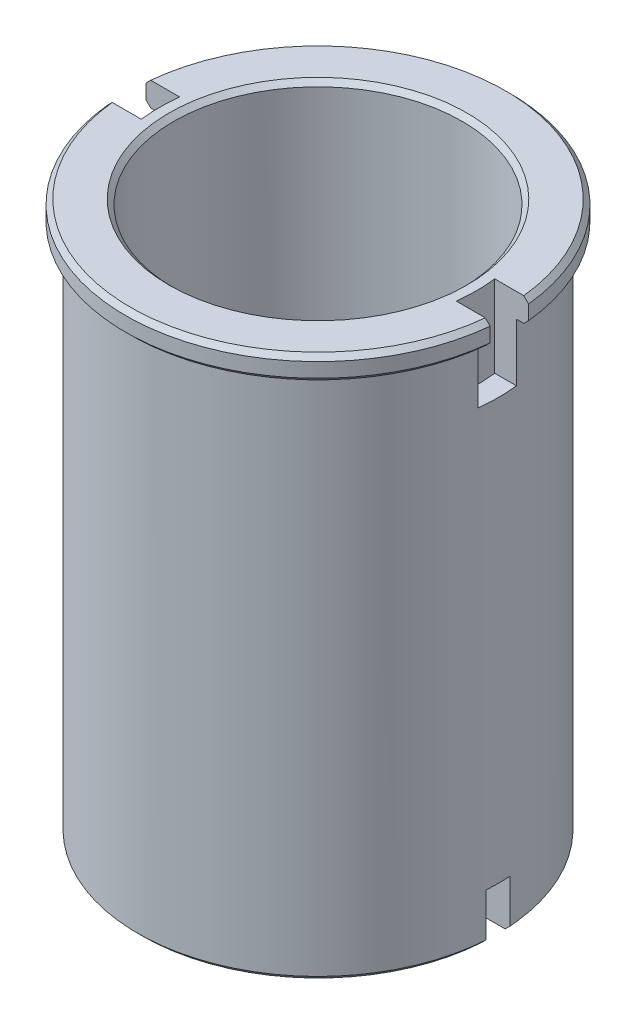
ISO-10303-21;
HEADER;
FILE_DESCRIPTION(('STEP AP214'),'2;1');
FILE_NAME('part.step','',(''),(''),'','','');
FILE_SCHEMA(('AUTOMOTIVE_DESIGN { 1 0 10303 214 1 1 1 1 }'));
ENDSEC;
DATA;
#1=APPLICATION_CONTEXT('core data for automotive mechanical design processes');
#2=APPLICATION_PROTOCOL_DEFINITION('international standard','automotive_design',2000,#1);
#3=PRODUCT_CONTEXT('',#1,'mechanical');
#4=PRODUCT('Part','Part','',(#3));
#5=PRODUCT_RELATED_PRODUCT_CATEGORY('part','',(#4));
#6=PRODUCT_DEFINITION_FORMATION('','',#4);
#7=PRODUCT_DEFINITION_CONTEXT('part definition',#1,'design');
#8=PRODUCT_DEFINITION('design','',#6,#7);
#9=PRODUCT_DEFINITION_SHAPE('','',#8);
#10=(LENGTH_UNIT() NAMED_UNIT(*) SI_UNIT(.MILLI.,.METRE.));
#11=(NAMED_UNIT(*) PLANE_ANGLE_UNIT() SI_UNIT($,.RADIAN.));
#12=(NAMED_UNIT(*) SI_UNIT($,.STERADIAN.) SOLID_ANGLE_UNIT());
#13=UNCERTAINTY_MEASURE_WITH_UNIT(LENGTH_MEASURE(1.E-05),#10,'distance_accuracy_value','');
#14=(GEOMETRIC_REPRESENTATION_CONTEXT(3) GLOBAL_UNCERTAINTY_ASSIGNED_CONTEXT((#13)) GLOBAL_UNIT_ASSIGNED_CONTEXT((#10,
#11,#12)) REPRESENTATION_CONTEXT('',''));
#15=CARTESIAN_POINT('',(0.,0.,0.));
#16=DIRECTION('',(0.,0.,1.));
#17=DIRECTION('',(1.,0.,0.));
#18=AXIS2_PLACEMENT_3D('',#15,#16,#17);
#19=CARTESIAN_POINT('',(0.,57.25,0.));
#20=DIRECTION('',(0.,-1.,0.));
#21=DIRECTION('',(0.,0.,-1.));
#22=AXIS2_PLACEMENT_3D('',#19,#20,#21);
#23=CYLINDRICAL_SURFACE('',#22,37.5);
#24=DIRECTION('',(0.,-1.,0.));
#25=VECTOR('',#24,1.);
#26=CARTESIAN_POINT('',(-37.4165738677394,57.25,2.5));
#27=LINE('',#26,#25);
#28=CARTESIAN_POINT('',(-37.4165738677394,-47.25,2.5));
#29=VERTEX_POINT('',#28);
#30=CARTESIAN_POINT('',(-37.4165738677394,-56.2499999999999,2.5));
#31=VERTEX_POINT('',#30);
#32=EDGE_CURVE('E323',#29,#31,#27,.T.);
#33=ORIENTED_EDGE('',*,*,#32,.T.);
#34=CARTESIAN_POINT('',(0.,-56.2499999999999,0.));
#35=DIRECTION('',(0.,1.,0.));
#36=DIRECTION('',(0.,0.,1.));
#37=AXIS2_PLACEMENT_3D('',#34,#35,#36);
#38=CIRCLE('',#37,37.5);
#39=CARTESIAN_POINT('',(37.4165738677394,-56.2499999999999,2.5));
#40=VERTEX_POINT('',#39);
#41=EDGE_CURVE('E528',#31,#40,#38,.T.);
#42=ORIENTED_EDGE('',*,*,#41,.T.);
#43=DIRECTION('',(0.,-1.,0.));
#44=VECTOR('',#43,1.);
#45=CARTESIAN_POINT('',(37.4165738677394,57.25,2.5));
#46=LINE('',#45,#44);
#47=CARTESIAN_POINT('',(37.4165738677394,-47.25,2.5));
#48=VERTEX_POINT('',#47);
#49=EDGE_CURVE('E321',#40,#48,#46,.F.);
#50=ORIENTED_EDGE('',*,*,#49,.T.);
#51=CARTESIAN_POINT('',(0.,-47.25,0.));
#52=DIRECTION('',(0.,-1.,0.));
#53=DIRECTION('',(0.,0.,-1.));
#54=AXIS2_PLACEMENT_3D('',#51,#52,#53);
#55=CIRCLE('',#54,37.5);
#56=CARTESIAN_POINT('',(37.4165738677394,-47.25,-2.5));
#57=VERTEX_POINT('',#56);
#58=EDGE_CURVE('E320',#57,#48,#55,.T.);
#59=ORIENTED_EDGE('',*,*,#58,.F.);
#60=DIRECTION('',(0.,-1.,0.));
#61=VECTOR('',#60,1.);
#62=CARTESIAN_POINT('',(37.4165738677394,57.25,-2.5));
#63=LINE('',#62,#61);
#64=CARTESIAN_POINT('',(37.4165738677394,-56.2499999999999,-2.5));
#65=VERTEX_POINT('',#64);
#66=EDGE_CURVE('E328',#57,#65,#63,.T.);
#67=ORIENTED_EDGE('',*,*,#66,.T.);
#68=CARTESIAN_POINT('',(0.,-56.2499999999999,0.));
#69=DIRECTION('',(0.,1.,0.));
#70=DIRECTION('',(0.,0.,1.));
#71=AXIS2_PLACEMENT_3D('',#68,#69,#70);
#72=CIRCLE('',#71,37.5);
#73=CARTESIAN_POINT('',(-37.4165738677394,-56.2499999999999,-2.5));
#74=VERTEX_POINT('',#73);
#75=EDGE_CURVE('E531',#65,#74,#72,.T.);
#76=ORIENTED_EDGE('',*,*,#75,.T.);
#77=DIRECTION('',(0.,-1.,0.));
#78=VECTOR('',#77,1.);
#79=CARTESIAN_POINT('',(-37.4165738677394,57.25,-2.5));
#80=LINE('',#79,#78);
#81=CARTESIAN_POINT('',(-37.4165738677394,-47.25,-2.5));
#82=VERTEX_POINT('',#81);
#83=EDGE_CURVE('E326',#74,#82,#80,.F.);
#84=ORIENTED_EDGE('',*,*,#83,.T.);
#85=EDGE_CURVE('E317',#29,#82,#55,.T.);
#86=ORIENTED_EDGE('',*,*,#85,.F.);
#87=EDGE_LOOP('',(#33,#42,#50,#59,#67,#76,#84,#86));
#88=FACE_BOUND('',#87,.T.);
#89=CARTESIAN_POINT('',(0.,52.25,0.));
#90=DIRECTION('',(0.,1.,0.));
#91=DIRECTION('',(0.,0.,1.));
#92=AXIS2_PLACEMENT_3D('',#89,#90,#91);
#93=CIRCLE('',#92,37.5);
#94=CARTESIAN_POINT('',(37.2860563750043,52.25,-4.00000000000001));
#95=VERTEX_POINT('',#94);
#96=CARTESIAN_POINT('',(-37.2860563750043,52.25,-4.));
#97=VERTEX_POINT('',#96);
#98=EDGE_CURVE('E334',#95,#97,#93,.T.);
#99=ORIENTED_EDGE('',*,*,#98,.F.);
#100=DIRECTION('',(0.,-1.,0.));
#101=VECTOR('',#100,1.);
#102=CARTESIAN_POINT('',(37.2860563750043,57.25,-4.00000000000001));
#103=LINE('',#102,#101);
#104=CARTESIAN_POINT('',(37.2860563750043,40.25,-4.00000000000001));
#105=VERTEX_POINT('',#104);
#106=EDGE_CURVE('E299',#95,#105,#103,.T.);
#107=ORIENTED_EDGE('',*,*,#106,.T.);
#108=CARTESIAN_POINT('',(0.,40.25,0.));
#109=DIRECTION('',(0.,1.,0.));
#110=DIRECTION('',(0.,0.,1.));
#111=AXIS2_PLACEMENT_3D('',#108,#109,#110);
#112=CIRCLE('',#111,37.5);
#113=CARTESIAN_POINT('',(37.2860563750043,40.25,3.99999999999999));
#114=VERTEX_POINT('',#113);
#115=EDGE_CURVE('E360',#114,#105,#112,.T.);
#116=ORIENTED_EDGE('',*,*,#115,.F.);
#117=DIRECTION('',(0.,-1.,0.));
#118=VECTOR('',#117,1.);
#119=CARTESIAN_POINT('',(37.2860563750043,57.25,3.99999999999999));
#120=LINE('',#119,#118);
#121=CARTESIAN_POINT('',(37.2860563750043,52.25,3.99999999999999));
#122=VERTEX_POINT('',#121);
#123=EDGE_CURVE('E231',#122,#114,#120,.T.);
#124=ORIENTED_EDGE('',*,*,#123,.F.);
#125=CARTESIAN_POINT('',(-37.2860563750043,52.25,4.));
#126=VERTEX_POINT('',#125);
#127=EDGE_CURVE('E331',#126,#122,#93,.T.);
#128=ORIENTED_EDGE('',*,*,#127,.F.);
#129=DIRECTION('',(0.,-1.,0.));
#130=VECTOR('',#129,1.);
#131=CARTESIAN_POINT('',(-37.2860563750043,57.25,4.));
#132=LINE('',#131,#130);
#133=CARTESIAN_POINT('',(-37.2860563750043,40.25,4.));
#134=VERTEX_POINT('',#133);
#135=EDGE_CURVE('E296',#134,#126,#132,.F.);
#136=ORIENTED_EDGE('',*,*,#135,.F.);
#137=CARTESIAN_POINT('',(0.,40.25,0.));
#138=DIRECTION('',(0.,1.,0.));
#139=DIRECTION('',(0.,0.,1.));
#140=AXIS2_PLACEMENT_3D('',#137,#138,#139);
#141=CIRCLE('',#140,37.5);
#142=CARTESIAN_POINT('',(-37.2860563750043,40.25,-4.));
#143=VERTEX_POINT('',#142);
#144=EDGE_CURVE('E358',#143,#134,#141,.T.);
#145=ORIENTED_EDGE('',*,*,#144,.F.);
#146=DIRECTION('',(0.,-1.,0.));
#147=VECTOR('',#146,1.);
#148=CARTESIAN_POINT('',(-37.2860563750043,57.25,-4.));
#149=LINE('',#148,#147);
#150=EDGE_CURVE('E260',#143,#97,#149,.F.);
#151=ORIENTED_EDGE('',*,*,#150,.T.);
#152=EDGE_LOOP('',(#99,#107,#116,#124,#128,#136,#145,#151));
#153=FACE_BOUND('',#152,.T.);
#154=ADVANCED_FACE('F34',(#88,#153),#23,.T.);
#155=CARTESIAN_POINT('',(0.,57.25,0.));
#156=DIRECTION('',(0.,1.,0.));
#157=DIRECTION('',(0.,0.,1.));
#158=AXIS2_PLACEMENT_3D('',#155,#156,#157);
#159=PLANE('',#158);
#160=CARTESIAN_POINT('',(0.,57.25,0.));
#161=DIRECTION('',(0.,1.,0.));
#162=DIRECTION('',(0.,0.,1.));
#163=AXIS2_PLACEMENT_3D('',#160,#161,#162);
#164=CIRCLE('',#163,31.0000000000001);
#165=CARTESIAN_POINT('',(0.,57.25,31.0000000000001));
#166=VERTEX_POINT('',#165);
#167=EDGE_CURVE('E362',#166,#166,#164,.F.);
#168=ORIENTED_EDGE('',*,*,#167,.T.);
#169=EDGE_LOOP('',(#168));
#170=FACE_BOUND('',#169,.T.);
#171=DIRECTION('',(-1.,0.,0.));
#172=VECTOR('',#171,1.);
#173=CARTESIAN_POINT('',(0.,57.25,-4.));
#174=LINE('',#173,#172);
#175=CARTESIAN_POINT('',(38.7943294825416,57.25,-4.00000000000001));
#176=VERTEX_POINT('',#175);
#177=CARTESIAN_POINT('',(32.7566787083184,57.25,-4.));
#178=VERTEX_POINT('',#177);
#179=EDGE_CURVE('E249',#176,#178,#174,.T.);
#180=ORIENTED_EDGE('',*,*,#179,.F.);
#181=CARTESIAN_POINT('',(0.,57.25,0.));
#182=DIRECTION('',(0.,1.,0.));
#183=DIRECTION('',(0.,0.,1.));
#184=AXIS2_PLACEMENT_3D('',#181,#182,#183);
#185=CIRCLE('',#184,39.);
#186=CARTESIAN_POINT('',(-38.7943294825416,57.25,-4.));
#187=VERTEX_POINT('',#186);
#188=EDGE_CURVE('E368',#176,#187,#185,.T.);
#189=ORIENTED_EDGE('',*,*,#188,.T.);
#190=DIRECTION('',(-1.,0.,0.));
#191=VECTOR('',#190,1.);
#192=CARTESIAN_POINT('',(0.,57.25,-4.));
#193=LINE('',#192,#191);
#194=CARTESIAN_POINT('',(-32.7566787083184,57.25,-4.));
#195=VERTEX_POINT('',#194);
#196=EDGE_CURVE('E280',#195,#187,#193,.T.);
#197=ORIENTED_EDGE('',*,*,#196,.F.);
#198=CARTESIAN_POINT('',(0.,57.25,0.));
#199=DIRECTION('',(0.,1.,0.));
#200=DIRECTION('',(0.,0.,1.));
#201=AXIS2_PLACEMENT_3D('',#198,#199,#200);
#202=CIRCLE('',#201,33.);
#203=CARTESIAN_POINT('',(-32.7566787083184,57.25,4.));
#204=VERTEX_POINT('',#203);
#205=EDGE_CURVE('E277',#195,#204,#202,.T.);
#206=ORIENTED_EDGE('',*,*,#205,.T.);
#207=DIRECTION('',(-1.,0.,0.));
#208=VECTOR('',#207,1.);
#209=CARTESIAN_POINT('',(0.,57.25,4.));
#210=LINE('',#209,#208);
#211=CARTESIAN_POINT('',(-38.7943294825416,57.25,4.));
#212=VERTEX_POINT('',#211);
#213=EDGE_CURVE('E270',#204,#212,#210,.T.);
#214=ORIENTED_EDGE('',*,*,#213,.T.);
#215=CARTESIAN_POINT('',(0.,57.25,0.));
#216=DIRECTION('',(0.,1.,0.));
#217=DIRECTION('',(0.,0.,1.));
#218=AXIS2_PLACEMENT_3D('',#215,#216,#217);
#219=CIRCLE('',#218,39.);
#220=CARTESIAN_POINT('',(38.7943294825416,57.25,3.99999999999999));
#221=VERTEX_POINT('',#220);
#222=EDGE_CURVE('E365',#212,#221,#219,.T.);
#223=ORIENTED_EDGE('',*,*,#222,.T.);
#224=DIRECTION('',(-1.,0.,0.));
#225=VECTOR('',#224,1.);
#226=CARTESIAN_POINT('',(0.,57.25,4.));
#227=LINE('',#226,#225);
#228=CARTESIAN_POINT('',(32.7566787083184,57.25,4.));
#229=VERTEX_POINT('',#228);
#230=EDGE_CURVE('E251',#221,#229,#227,.T.);
#231=ORIENTED_EDGE('',*,*,#230,.T.);
#232=CARTESIAN_POINT('',(0.,57.25,0.));
#233=DIRECTION('',(0.,1.,0.));
#234=DIRECTION('',(0.,0.,1.));
#235=AXIS2_PLACEMENT_3D('',#232,#233,#234);
#236=CIRCLE('',#235,33.);
#237=EDGE_CURVE('E244',#229,#178,#236,.T.);
#238=ORIENTED_EDGE('',*,*,#237,.T.);
#239=EDGE_LOOP('',(#180,#189,#197,#206,#214,#223,#231,#238));
#240=FACE_BOUND('',#239,.T.);
#241=ADVANCED_FACE('F582',(#170,#240),#159,.T.);
#242=CARTESIAN_POINT('',(0.,52.25,0.));
#243=DIRECTION('',(0.,1.,0.));
#244=DIRECTION('',(0.,0.,1.));
#245=AXIS2_PLACEMENT_3D('',#242,#243,#244);
#246=CYLINDRICAL_SURFACE('',#245,40.);
#247=DIRECTION('',(0.,1.,0.));
#248=VECTOR('',#247,1.);
#249=CARTESIAN_POINT('',(39.7994974842648,40.25,3.99999999999999));
#250=LINE('',#249,#248);
#251=CARTESIAN_POINT('',(39.7994974842648,53.25,3.99999999999999));
#252=VERTEX_POINT('',#251);
#253=CARTESIAN_POINT('',(39.7994974842648,56.25,3.99999999999999));
#254=VERTEX_POINT('',#253);
#255=EDGE_CURVE('E245',#252,#254,#250,.T.);
#256=ORIENTED_EDGE('',*,*,#255,.T.);
#257=CARTESIAN_POINT('',(0.,56.25,0.));
#258=DIRECTION('',(0.,1.,0.));
#259=DIRECTION('',(0.,0.,1.));
#260=AXIS2_PLACEMENT_3D('',#257,#258,#259);
#261=CIRCLE('',#260,40.);
#262=CARTESIAN_POINT('',(-39.7994974842648,56.25,4.));
#263=VERTEX_POINT('',#262);
#264=EDGE_CURVE('E547',#254,#263,#261,.F.);
#265=ORIENTED_EDGE('',*,*,#264,.T.);
#266=DIRECTION('',(0.,1.,0.));
#267=VECTOR('',#266,1.);
#268=CARTESIAN_POINT('',(-39.7994974842648,40.25,4.));
#269=LINE('',#268,#267);
#270=CARTESIAN_POINT('',(-39.7994974842648,53.25,4.));
#271=VERTEX_POINT('',#270);
#272=EDGE_CURVE('E287',#271,#263,#269,.T.);
#273=ORIENTED_EDGE('',*,*,#272,.F.);
#274=CARTESIAN_POINT('',(0.,53.25,0.));
#275=DIRECTION('',(0.,1.,0.));
#276=DIRECTION('',(0.,0.,1.));
#277=AXIS2_PLACEMENT_3D('',#274,#275,#276);
#278=CIRCLE('',#277,40.);
#279=EDGE_CURVE('E549',#271,#252,#278,.T.);
#280=ORIENTED_EDGE('',*,*,#279,.T.);
#281=EDGE_LOOP('',(#256,#265,#273,#280));
#282=FACE_BOUND('',#281,.T.);
#283=ADVANCED_FACE('F587',(#282),#246,.T.);
#284=DIRECTION('',(0.,1.,0.));
#285=VECTOR('',#284,1.);
#286=CARTESIAN_POINT('',(-39.7994974842648,40.25,-4.));
#287=LINE('',#286,#285);
#288=CARTESIAN_POINT('',(-39.7994974842648,53.25,-4.));
#289=VERTEX_POINT('',#288);
#290=CARTESIAN_POINT('',(-39.7994974842648,56.25,-4.));
#291=VERTEX_POINT('',#290);
#292=EDGE_CURVE('E290',#289,#291,#287,.T.);
#293=ORIENTED_EDGE('',*,*,#292,.T.);
#294=CARTESIAN_POINT('',(0.,56.25,0.));
#295=DIRECTION('',(0.,1.,0.));
#296=DIRECTION('',(0.,0.,1.));
#297=AXIS2_PLACEMENT_3D('',#294,#295,#296);
#298=CIRCLE('',#297,40.);
#299=CARTESIAN_POINT('',(39.7994974842648,56.25,-4.00000000000001));
#300=VERTEX_POINT('',#299);
#301=EDGE_CURVE('E611',#291,#300,#298,.F.);
#302=ORIENTED_EDGE('',*,*,#301,.T.);
#303=DIRECTION('',(0.,1.,0.));
#304=VECTOR('',#303,1.);
#305=CARTESIAN_POINT('',(39.7994974842648,40.25,-4.00000000000001));
#306=LINE('',#305,#304);
#307=CARTESIAN_POINT('',(39.7994974842648,53.25,-4.00000000000001));
#308=VERTEX_POINT('',#307);
#309=EDGE_CURVE('E261',#308,#300,#306,.T.);
#310=ORIENTED_EDGE('',*,*,#309,.F.);
#311=CARTESIAN_POINT('',(0.,53.25,0.));
#312=DIRECTION('',(0.,1.,0.));
#313=DIRECTION('',(0.,0.,1.));
#314=AXIS2_PLACEMENT_3D('',#311,#312,#313);
#315=CIRCLE('',#314,40.);
#316=EDGE_CURVE('E612',#308,#289,#315,.T.);
#317=ORIENTED_EDGE('',*,*,#316,.T.);
#318=EDGE_LOOP('',(#293,#302,#310,#317));
#319=FACE_BOUND('',#318,.T.);
#320=ADVANCED_FACE('F621',(#319),#246,.T.);
#321=CARTESIAN_POINT('',(0.,52.25,0.));
#322=DIRECTION('',(0.,1.,0.));
#323=DIRECTION('',(0.,0.,1.));
#324=AXIS2_PLACEMENT_3D('',#321,#322,#323);
#325=PLANE('',#324);
#326=DIRECTION('',(-1.,0.,0.));
#327=VECTOR('',#326,1.);
#328=CARTESIAN_POINT('',(0.,52.25,4.));
#329=LINE('',#328,#327);
#330=CARTESIAN_POINT('',(38.7943294825416,52.25,3.99999999999999));
#331=VERTEX_POINT('',#330);
#332=EDGE_CURVE('E354',#331,#122,#329,.T.);
#333=ORIENTED_EDGE('',*,*,#332,.F.);
#334=CARTESIAN_POINT('',(0.,52.25,0.));
#335=DIRECTION('',(0.,1.,0.));
#336=DIRECTION('',(0.,0.,1.));
#337=AXIS2_PLACEMENT_3D('',#334,#335,#336);
#338=CIRCLE('',#337,39.);
#339=CARTESIAN_POINT('',(-38.7943294825416,52.25,4.));
#340=VERTEX_POINT('',#339);
#341=EDGE_CURVE('E11',#331,#340,#338,.F.);
#342=ORIENTED_EDGE('',*,*,#341,.T.);
#343=DIRECTION('',(-1.,0.,0.));
#344=VECTOR('',#343,1.);
#345=CARTESIAN_POINT('',(0.,52.25,4.));
#346=LINE('',#345,#344);
#347=EDGE_CURVE('E351',#126,#340,#346,.T.);
#348=ORIENTED_EDGE('',*,*,#347,.F.);
#349=ORIENTED_EDGE('',*,*,#127,.T.);
#350=EDGE_LOOP('',(#333,#342,#348,#349));
#351=FACE_BOUND('',#350,.T.);
#352=ADVANCED_FACE('F644',(#351),#325,.F.);
#353=DIRECTION('',(-1.,0.,0.));
#354=VECTOR('',#353,1.);
#355=CARTESIAN_POINT('',(0.,52.25,-4.));
#356=LINE('',#355,#354);
#357=CARTESIAN_POINT('',(-38.7943294825416,52.25,-4.));
#358=VERTEX_POINT('',#357);
#359=EDGE_CURVE('E348',#97,#358,#356,.T.);
#360=ORIENTED_EDGE('',*,*,#359,.T.);
#361=CARTESIAN_POINT('',(0.,52.25,0.));
#362=DIRECTION('',(0.,1.,0.));
#363=DIRECTION('',(0.,0.,1.));
#364=AXIS2_PLACEMENT_3D('',#361,#362,#363);
#365=CIRCLE('',#364,39.);
#366=CARTESIAN_POINT('',(38.7943294825416,52.25,-4.00000000000001));
#367=VERTEX_POINT('',#366);
#368=EDGE_CURVE('E44',#358,#367,#365,.F.);
#369=ORIENTED_EDGE('',*,*,#368,.T.);
#370=DIRECTION('',(-1.,0.,0.));
#371=VECTOR('',#370,1.);
#372=CARTESIAN_POINT('',(0.,52.25,-4.));
#373=LINE('',#372,#371);
#374=EDGE_CURVE('E356',#367,#95,#373,.T.);
#375=ORIENTED_EDGE('',*,*,#374,.T.);
#376=ORIENTED_EDGE('',*,*,#98,.T.);
#377=EDGE_LOOP('',(#360,#369,#375,#376));
#378=FACE_BOUND('',#377,.T.);
#379=ADVANCED_FACE('F663',(#378),#325,.F.);
#380=CARTESIAN_POINT('',(0.,-57.25,0.));
#381=DIRECTION('',(0.,1.,0.));
#382=DIRECTION('',(0.,0.,1.));
#383=AXIS2_PLACEMENT_3D('',#380,#381,#382);
#384=PLANE('',#383);
#385=DIRECTION('',(1.,0.,0.));
#386=VECTOR('',#385,1.);
#387=CARTESIAN_POINT('',(-45.,-57.25,-2.5));
#388=LINE('',#387,#386);
#389=CARTESIAN_POINT('',(-36.4142829120661,-57.25,-2.5));
#390=VERTEX_POINT('',#389);
#391=CARTESIAN_POINT('',(-30.8990291109607,-57.25,-2.5));
#392=VERTEX_POINT('',#391);
#393=EDGE_CURVE('E307',#390,#392,#388,.T.);
#394=ORIENTED_EDGE('',*,*,#393,.F.);
#395=CARTESIAN_POINT('',(0.,-57.25,0.));
#396=DIRECTION('',(0.,1.,0.));
#397=DIRECTION('',(0.,0.,1.));
#398=AXIS2_PLACEMENT_3D('',#395,#396,#397);
#399=CIRCLE('',#398,36.4999999999999);
#400=CARTESIAN_POINT('',(36.4142829120661,-57.25,-2.5));
#401=VERTEX_POINT('',#400);
#402=EDGE_CURVE('E59',#390,#401,#399,.F.);
#403=ORIENTED_EDGE('',*,*,#402,.T.);
#404=CARTESIAN_POINT('',(30.8990291109607,-57.25,-2.5));
#405=VERTEX_POINT('',#404);
#406=EDGE_CURVE('E315',#405,#401,#388,.T.);
#407=ORIENTED_EDGE('',*,*,#406,.F.);
#408=CARTESIAN_POINT('',(0.,-57.25,0.));
#409=DIRECTION('',(0.,1.,0.));
#410=DIRECTION('',(0.,0.,1.));
#411=AXIS2_PLACEMENT_3D('',#408,#409,#410);
#412=CIRCLE('',#411,31.);
#413=EDGE_CURVE('E680',#405,#392,#412,.T.);
#414=ORIENTED_EDGE('',*,*,#413,.T.);
#415=EDGE_LOOP('',(#394,#403,#407,#414));
#416=FACE_BOUND('',#415,.T.);
#417=ADVANCED_FACE('F688',(#416),#384,.F.);
#418=DIRECTION('',(-1.,0.,0.));
#419=VECTOR('',#418,1.);
#420=CARTESIAN_POINT('',(-45.,-57.25,2.5));
#421=LINE('',#420,#419);
#422=CARTESIAN_POINT('',(36.4142829120661,-57.25,2.5));
#423=VERTEX_POINT('',#422);
#424=CARTESIAN_POINT('',(30.8990291109607,-57.25,2.5));
#425=VERTEX_POINT('',#424);
#426=EDGE_CURVE('E314',#423,#425,#421,.T.);
#427=ORIENTED_EDGE('',*,*,#426,.F.);
#428=CARTESIAN_POINT('',(0.,-57.25,0.));
#429=DIRECTION('',(0.,1.,0.));
#430=DIRECTION('',(0.,0.,1.));
#431=AXIS2_PLACEMENT_3D('',#428,#429,#430);
#432=CIRCLE('',#431,36.4999999999999);
#433=CARTESIAN_POINT('',(-36.4142829120661,-57.25,2.5));
#434=VERTEX_POINT('',#433);
#435=EDGE_CURVE('E491',#423,#434,#432,.F.);
#436=ORIENTED_EDGE('',*,*,#435,.T.);
#437=CARTESIAN_POINT('',(-30.8990291109607,-57.25,2.5));
#438=VERTEX_POINT('',#437);
#439=EDGE_CURVE('E302',#438,#434,#421,.T.);
#440=ORIENTED_EDGE('',*,*,#439,.F.);
#441=CARTESIAN_POINT('',(0.,-57.25,0.));
#442=DIRECTION('',(0.,1.,0.));
#443=DIRECTION('',(0.,0.,1.));
#444=AXIS2_PLACEMENT_3D('',#441,#442,#443);
#445=CIRCLE('',#444,31.);
#446=EDGE_CURVE('E514',#438,#425,#445,.T.);
#447=ORIENTED_EDGE('',*,*,#446,.T.);
#448=EDGE_LOOP('',(#427,#436,#440,#447));
#449=FACE_BOUND('',#448,.T.);
#450=ADVANCED_FACE('F522',(#449),#384,.F.);
#451=CARTESIAN_POINT('',(0.,57.25,0.));
#452=DIRECTION('',(0.,-1.,0.));
#453=DIRECTION('',(0.,0.,-1.));
#454=AXIS2_PLACEMENT_3D('',#451,#452,#453);
#455=CYLINDRICAL_SURFACE('',#454,30.);
#456=CARTESIAN_POINT('',(0.,56.2499999999999,0.));
#457=DIRECTION('',(0.,1.,0.));
#458=DIRECTION('',(0.,0.,1.));
#459=AXIS2_PLACEMENT_3D('',#456,#457,#458);
#460=CIRCLE('',#459,30.);
#461=CARTESIAN_POINT('',(0.,56.2499999999999,30.));
#462=VERTEX_POINT('',#461);
#463=EDGE_CURVE('E667',#462,#462,#460,.T.);
#464=ORIENTED_EDGE('',*,*,#463,.T.);
#465=EDGE_LOOP('',(#464));
#466=FACE_BOUND('',#465,.T.);
#467=DIRECTION('',(0.,-1.,0.));
#468=VECTOR('',#467,1.);
#469=CARTESIAN_POINT('',(-29.8956518577535,57.25,-2.5));
#470=LINE('',#469,#468);
#471=CARTESIAN_POINT('',(-29.8956518577535,-56.25,-2.5));
#472=VERTEX_POINT('',#471);
#473=CARTESIAN_POINT('',(-29.8956518577535,-47.25,-2.5));
#474=VERTEX_POINT('',#473);
#475=EDGE_CURVE('E342',#472,#474,#470,.F.);
#476=ORIENTED_EDGE('',*,*,#475,.F.);
#477=CARTESIAN_POINT('',(0.,-56.25,0.));
#478=DIRECTION('',(0.,1.,0.));
#479=DIRECTION('',(0.,0.,1.));
#480=AXIS2_PLACEMENT_3D('',#477,#478,#479);
#481=CIRCLE('',#480,30.);
#482=CARTESIAN_POINT('',(29.8956518577535,-56.25,-2.5));
#483=VERTEX_POINT('',#482);
#484=EDGE_CURVE('E51',#472,#483,#481,.F.);
#485=ORIENTED_EDGE('',*,*,#484,.T.);
#486=DIRECTION('',(0.,-1.,0.));
#487=VECTOR('',#486,1.);
#488=CARTESIAN_POINT('',(29.8956518577535,57.25,-2.5));
#489=LINE('',#488,#487);
#490=CARTESIAN_POINT('',(29.8956518577535,-47.25,-2.5));
#491=VERTEX_POINT('',#490);
#492=EDGE_CURVE('E346',#491,#483,#489,.T.);
#493=ORIENTED_EDGE('',*,*,#492,.F.);
#494=CARTESIAN_POINT('',(0.,-47.25,0.));
#495=DIRECTION('',(0.,-1.,0.));
#496=DIRECTION('',(0.,0.,-1.));
#497=AXIS2_PLACEMENT_3D('',#494,#495,#496);
#498=CIRCLE('',#497,30.);
#499=CARTESIAN_POINT('',(29.8956518577535,-47.25,2.5));
#500=VERTEX_POINT('',#499);
#501=EDGE_CURVE('E339',#491,#500,#498,.T.);
#502=ORIENTED_EDGE('',*,*,#501,.T.);
#503=DIRECTION('',(0.,-1.,0.));
#504=VECTOR('',#503,1.);
#505=CARTESIAN_POINT('',(29.8956518577535,57.25,2.5));
#506=LINE('',#505,#504);
#507=CARTESIAN_POINT('',(29.8956518577535,-56.25,2.5));
#508=VERTEX_POINT('',#507);
#509=EDGE_CURVE('E344',#508,#500,#506,.F.);
#510=ORIENTED_EDGE('',*,*,#509,.F.);
#511=CARTESIAN_POINT('',(0.,-56.25,0.));
#512=DIRECTION('',(0.,1.,0.));
#513=DIRECTION('',(0.,0.,1.));
#514=AXIS2_PLACEMENT_3D('',#511,#512,#513);
#515=CIRCLE('',#514,30.);
#516=CARTESIAN_POINT('',(-29.8956518577535,-56.25,2.5));
#517=VERTEX_POINT('',#516);
#518=EDGE_CURVE('E664',#508,#517,#515,.F.);
#519=ORIENTED_EDGE('',*,*,#518,.T.);
#520=DIRECTION('',(0.,-1.,0.));
#521=VECTOR('',#520,1.);
#522=CARTESIAN_POINT('',(-29.8956518577535,57.25,2.5));
#523=LINE('',#522,#521);
#524=CARTESIAN_POINT('',(-29.8956518577535,-47.25,2.5));
#525=VERTEX_POINT('',#524);
#526=EDGE_CURVE('E338',#525,#517,#523,.T.);
#527=ORIENTED_EDGE('',*,*,#526,.F.);
#528=EDGE_CURVE('E335',#525,#474,#498,.T.);
#529=ORIENTED_EDGE('',*,*,#528,.T.);
#530=EDGE_LOOP('',(#476,#485,#493,#502,#510,#519,#527,#529));
#531=FACE_BOUND('',#530,.T.);
#532=ADVANCED_FACE('F685',(#466,#531),#455,.F.);
#533=CARTESIAN_POINT('',(0.,-47.25,0.));
#534=DIRECTION('',(0.,-1.,0.));
#535=DIRECTION('',(0.,0.,-1.));
#536=AXIS2_PLACEMENT_3D('',#533,#534,#535);
#537=PLANE('',#536);
#538=ORIENTED_EDGE('',*,*,#85,.T.);
#539=DIRECTION('',(1.,0.,0.));
#540=VECTOR('',#539,1.);
#541=CARTESIAN_POINT('',(-45.,-47.25,-2.5));
#542=LINE('',#541,#540);
#543=EDGE_CURVE('E311',#82,#474,#542,.T.);
#544=ORIENTED_EDGE('',*,*,#543,.T.);
#545=ORIENTED_EDGE('',*,*,#528,.F.);
#546=DIRECTION('',(-1.,0.,0.));
#547=VECTOR('',#546,1.);
#548=CARTESIAN_POINT('',(-45.,-47.25,2.5));
#549=LINE('',#548,#547);
#550=EDGE_CURVE('E303',#525,#29,#549,.T.);
#551=ORIENTED_EDGE('',*,*,#550,.T.);
#552=EDGE_LOOP('',(#538,#544,#545,#551));
#553=FACE_BOUND('',#552,.T.);
#554=ADVANCED_FACE('F409',(#553),#537,.T.);
#555=CARTESIAN_POINT('',(-45.,-47.25,2.5));
#556=DIRECTION('',(0.,0.,1.));
#557=DIRECTION('',(1.,0.,0.));
#558=AXIS2_PLACEMENT_3D('',#555,#556,#557);
#559=PLANE('',#558);
#560=ORIENTED_EDGE('',*,*,#439,.T.);
#561=CARTESIAN_POINT('',(-36.4142829120661,-57.25,2.5));
#562=CARTESIAN_POINT('',(-36.5813365703859,-57.0833385108742,2.5));
#563=CARTESIAN_POINT('',(-36.7483876458521,-56.9166744329777,2.5));
#564=CARTESIAN_POINT('',(-37.0824846310766,-56.5833410996443,2.5));
#565=CARTESIAN_POINT('',(-37.2495305408347,-56.4166718442074,2.5));
#566=CARTESIAN_POINT('',(-37.4165738677394,-56.2499999999999,2.5));
#567=B_SPLINE_CURVE_WITH_KNOTS('',3,(#561,#562,#563,#564,#565,#566),.UNSPECIFIED.,.F.,.F.,(4,2,
4),(0.,0.707917219793237,1.41583443958188),.UNSPECIFIED.);
#568=EDGE_CURVE('E490',#434,#31,#567,.T.);
#569=ORIENTED_EDGE('',*,*,#568,.T.);
#570=ORIENTED_EDGE('',*,*,#32,.F.);
#571=ORIENTED_EDGE('',*,*,#550,.F.);
#572=ORIENTED_EDGE('',*,*,#526,.T.);
#573=CARTESIAN_POINT('',(-29.8956518577535,-56.25,2.5));
#574=CARTESIAN_POINT('',(-30.0628906429538,-56.4166573924558,2.5));
#575=CARTESIAN_POINT('',(-30.2301248066556,-56.5833194220181,2.5));
#576=CARTESIAN_POINT('',(-30.564583891058,-56.9166527553514,2.5));
#577=CARTESIAN_POINT('',(-30.7318088117586,-57.0833240591225,2.5));
#578=CARTESIAN_POINT('',(-30.8990291109607,-57.25,2.5));
#579=B_SPLINE_CURVE_WITH_KNOTS('',3,(#573,#574,#575,#576,#577,#578),.UNSPECIFIED.,.F.,.F.,(4,2,
4),(0.,0.708301827233135,1.41660365444842),.UNSPECIFIED.);
#580=EDGE_CURVE('E484',#517,#438,#579,.T.);
#581=ORIENTED_EDGE('',*,*,#580,.T.);
#582=EDGE_LOOP('',(#560,#569,#570,#571,#572,#581));
#583=FACE_BOUND('',#582,.T.);
#584=ADVANCED_FACE('F416',(#583),#559,.F.);
#585=CARTESIAN_POINT('',(-45.,-47.25,-2.5));
#586=DIRECTION('',(0.,0.,-1.));
#587=DIRECTION('',(-1.,0.,0.));
#588=AXIS2_PLACEMENT_3D('',#585,#586,#587);
#589=PLANE('',#588);
#590=ORIENTED_EDGE('',*,*,#83,.F.);
#591=CARTESIAN_POINT('',(-37.4165738677394,-56.2499999999999,-2.5));
#592=CARTESIAN_POINT('',(-37.2495305408347,-56.4166718442074,-2.5));
#593=CARTESIAN_POINT('',(-37.0824846310766,-56.5833410996443,-2.5));
#594=CARTESIAN_POINT('',(-36.7483876458521,-56.9166744329777,-2.5));
#595=CARTESIAN_POINT('',(-36.5813365703859,-57.0833385108742,-2.5));
#596=CARTESIAN_POINT('',(-36.4142829120661,-57.25,-2.5));
#597=B_SPLINE_CURVE_WITH_KNOTS('',3,(#591,#592,#593,#594,#595,#596),.UNSPECIFIED.,.F.,.F.,(4,2,
4),(0.,0.707917219788641,1.41583443958188),.UNSPECIFIED.);
#598=EDGE_CURVE('E432',#74,#390,#597,.T.);
#599=ORIENTED_EDGE('',*,*,#598,.T.);
#600=ORIENTED_EDGE('',*,*,#393,.T.);
#601=CARTESIAN_POINT('',(-30.8990291109607,-57.25,-2.5));
#602=CARTESIAN_POINT('',(-30.7318088117586,-57.0833240591225,-2.5));
#603=CARTESIAN_POINT('',(-30.564583891058,-56.9166527553514,-2.5));
#604=CARTESIAN_POINT('',(-30.2301248066556,-56.5833194220181,-2.5));
#605=CARTESIAN_POINT('',(-30.0628906429538,-56.4166573924558,-2.5));
#606=CARTESIAN_POINT('',(-29.8956518577535,-56.25,-2.5));
#607=B_SPLINE_CURVE_WITH_KNOTS('',3,(#601,#602,#603,#604,#605,#606),.UNSPECIFIED.,.F.,.F.,(4,2,
4),(0.,0.708301827215283,1.41660365444842),.UNSPECIFIED.);
#608=EDGE_CURVE('E422',#392,#472,#607,.T.);
#609=ORIENTED_EDGE('',*,*,#608,.T.);
#610=ORIENTED_EDGE('',*,*,#475,.T.);
#611=ORIENTED_EDGE('',*,*,#543,.F.);
#612=EDGE_LOOP('',(#590,#599,#600,#609,#610,#611));
#613=FACE_BOUND('',#612,.T.);
#614=ADVANCED_FACE('F414',(#613),#589,.F.);
#615=ORIENTED_EDGE('',*,*,#406,.T.);
#616=CARTESIAN_POINT('',(36.4142829120661,-57.25,-2.5));
#617=CARTESIAN_POINT('',(36.5813365703859,-57.0833385108742,-2.5));
#618=CARTESIAN_POINT('',(36.7483876458521,-56.9166744329777,-2.5));
#619=CARTESIAN_POINT('',(37.0824846310766,-56.5833410996443,-2.5));
#620=CARTESIAN_POINT('',(37.2495305408347,-56.4166718442074,-2.5));
#621=CARTESIAN_POINT('',(37.4165738677394,-56.2499999999999,-2.5));
#622=B_SPLINE_CURVE_WITH_KNOTS('',3,(#616,#617,#618,#619,#620,#621),.UNSPECIFIED.,.F.,.F.,(4,2,
4),(0.,0.707917219793237,1.41583443958188),.UNSPECIFIED.);
#623=EDGE_CURVE('E446',#401,#65,#622,.T.);
#624=ORIENTED_EDGE('',*,*,#623,.T.);
#625=ORIENTED_EDGE('',*,*,#66,.F.);
#626=EDGE_CURVE('E308',#491,#57,#542,.T.);
#627=ORIENTED_EDGE('',*,*,#626,.F.);
#628=ORIENTED_EDGE('',*,*,#492,.T.);
#629=CARTESIAN_POINT('',(29.8956518577535,-56.25,-2.5));
#630=CARTESIAN_POINT('',(30.0628906429538,-56.4166573924558,-2.5));
#631=CARTESIAN_POINT('',(30.2301248066556,-56.5833194220181,-2.5));
#632=CARTESIAN_POINT('',(30.564583891058,-56.9166527553514,-2.5));
#633=CARTESIAN_POINT('',(30.7318088117586,-57.0833240591225,-2.5));
#634=CARTESIAN_POINT('',(30.8990291109607,-57.25,-2.5));
#635=B_SPLINE_CURVE_WITH_KNOTS('',3,(#629,#630,#631,#632,#633,#634),.UNSPECIFIED.,.F.,.F.,(4,2,
4),(0.,0.708301827233135,1.41660365444842),.UNSPECIFIED.);
#636=EDGE_CURVE('E440',#483,#405,#635,.T.);
#637=ORIENTED_EDGE('',*,*,#636,.T.);
#638=EDGE_LOOP('',(#615,#624,#625,#627,#628,#637));
#639=FACE_BOUND('',#638,.T.);
#640=ADVANCED_FACE('F410',(#639),#589,.F.);
#641=ORIENTED_EDGE('',*,*,#49,.F.);
#642=CARTESIAN_POINT('',(37.4165738677394,-56.2499999999999,2.5));
#643=CARTESIAN_POINT('',(37.2495305408347,-56.4166718442074,2.5));
#644=CARTESIAN_POINT('',(37.0824846310766,-56.5833410996443,2.5));
#645=CARTESIAN_POINT('',(36.7483876458521,-56.9166744329777,2.5));
#646=CARTESIAN_POINT('',(36.5813365703859,-57.0833385108742,2.5));
#647=CARTESIAN_POINT('',(36.4142829120661,-57.25,2.5));
#648=B_SPLINE_CURVE_WITH_KNOTS('',3,(#642,#643,#644,#645,#646,#647),.UNSPECIFIED.,.F.,.F.,(4,2,
4),(0.,0.707917219788641,1.41583443958188),.UNSPECIFIED.);
#649=EDGE_CURVE('E509',#40,#423,#648,.T.);
#650=ORIENTED_EDGE('',*,*,#649,.T.);
#651=ORIENTED_EDGE('',*,*,#426,.T.);
#652=CARTESIAN_POINT('',(30.8990291109607,-57.25,2.5));
#653=CARTESIAN_POINT('',(30.7318088117586,-57.0833240591225,2.5));
#654=CARTESIAN_POINT('',(30.564583891058,-56.9166527553514,2.5));
#655=CARTESIAN_POINT('',(30.2301248066556,-56.5833194220181,2.5));
#656=CARTESIAN_POINT('',(30.0628906429538,-56.4166573924558,2.5));
#657=CARTESIAN_POINT('',(29.8956518577535,-56.25,2.5));
#658=B_SPLINE_CURVE_WITH_KNOTS('',3,(#652,#653,#654,#655,#656,#657),.UNSPECIFIED.,.F.,.F.,(4,2,
4),(0.,0.708301827215283,1.41660365444842),.UNSPECIFIED.);
#659=EDGE_CURVE('E476',#425,#508,#658,.T.);
#660=ORIENTED_EDGE('',*,*,#659,.T.);
#661=ORIENTED_EDGE('',*,*,#509,.T.);
#662=EDGE_CURVE('E306',#48,#500,#549,.T.);
#663=ORIENTED_EDGE('',*,*,#662,.F.);
#664=EDGE_LOOP('',(#641,#650,#651,#660,#661,#663));
#665=FACE_BOUND('',#664,.T.);
#666=ADVANCED_FACE('F407',(#665),#559,.F.);
#667=ORIENTED_EDGE('',*,*,#58,.T.);
#668=ORIENTED_EDGE('',*,*,#662,.T.);
#669=ORIENTED_EDGE('',*,*,#501,.F.);
#670=ORIENTED_EDGE('',*,*,#626,.T.);
#671=EDGE_LOOP('',(#667,#668,#669,#670));
#672=FACE_BOUND('',#671,.T.);
#673=ADVANCED_FACE('F403',(#672),#537,.T.);
#674=CARTESIAN_POINT('',(0.,40.25,0.));
#675=DIRECTION('',(0.,1.,0.));
#676=DIRECTION('',(0.,0.,1.));
#677=AXIS2_PLACEMENT_3D('',#674,#675,#676);
#678=PLANE('',#677);
#679=ORIENTED_EDGE('',*,*,#144,.T.);
#680=DIRECTION('',(-1.,0.,0.));
#681=VECTOR('',#680,1.);
#682=CARTESIAN_POINT('',(0.,40.25,4.));
#683=LINE('',#682,#681);
#684=CARTESIAN_POINT('',(-32.7566787083184,40.25,4.));
#685=VERTEX_POINT('',#684);
#686=EDGE_CURVE('E273',#685,#134,#683,.T.);
#687=ORIENTED_EDGE('',*,*,#686,.F.);
#688=CARTESIAN_POINT('',(0.,40.25,0.));
#689=DIRECTION('',(0.,1.,0.));
#690=DIRECTION('',(0.,0.,1.));
#691=AXIS2_PLACEMENT_3D('',#688,#689,#690);
#692=CIRCLE('',#691,33.);
#693=CARTESIAN_POINT('',(-32.7566787083184,40.25,-4.));
#694=VERTEX_POINT('',#693);
#695=EDGE_CURVE('E266',#694,#685,#692,.T.);
#696=ORIENTED_EDGE('',*,*,#695,.F.);
#697=DIRECTION('',(-1.,0.,0.));
#698=VECTOR('',#697,1.);
#699=CARTESIAN_POINT('',(0.,40.25,-4.));
#700=LINE('',#699,#698);
#701=EDGE_CURVE('E269',#694,#143,#700,.T.);
#702=ORIENTED_EDGE('',*,*,#701,.T.);
#703=EDGE_LOOP('',(#679,#687,#696,#702));
#704=FACE_BOUND('',#703,.T.);
#705=ADVANCED_FACE('F406',(#704),#678,.T.);
#706=CARTESIAN_POINT('',(0.,40.25,4.));
#707=DIRECTION('',(0.,0.,-1.));
#708=DIRECTION('',(-1.,0.,0.));
#709=AXIS2_PLACEMENT_3D('',#706,#707,#708);
#710=PLANE('',#709);
#711=ORIENTED_EDGE('',*,*,#272,.T.);
#712=CARTESIAN_POINT('',(-39.7994974842648,56.25,4.));
#713=CARTESIAN_POINT('',(-39.6319804149652,56.416677654141,4.));
#714=CARTESIAN_POINT('',(-39.4644578801729,56.5833498145437,4.));
#715=CARTESIAN_POINT('',(-39.1294018795985,56.9166831478771,4.));
#716=CARTESIAN_POINT('',(-38.9618684138164,57.0833443208077,4.));
#717=CARTESIAN_POINT('',(-38.7943294825416,57.25,4.));
#718=B_SPLINE_CURVE_WITH_KNOTS('',3,(#712,#713,#714,#715,#716,#717),.UNSPECIFIED.,.F.,.F.,(4,2,
4),(0.,0.708936300699033,1.41787260141738),.UNSPECIFIED.);
#719=EDGE_CURVE('E533',#263,#212,#718,.T.);
#720=ORIENTED_EDGE('',*,*,#719,.T.);
#721=ORIENTED_EDGE('',*,*,#213,.F.);
#722=DIRECTION('',(0.,1.,0.));
#723=VECTOR('',#722,1.);
#724=CARTESIAN_POINT('',(-32.7566787083184,40.25,4.));
#725=LINE('',#724,#723);
#726=EDGE_CURVE('E256',#685,#204,#725,.T.);
#727=ORIENTED_EDGE('',*,*,#726,.F.);
#728=ORIENTED_EDGE('',*,*,#686,.T.);
#729=ORIENTED_EDGE('',*,*,#135,.T.);
#730=ORIENTED_EDGE('',*,*,#347,.T.);
#731=CARTESIAN_POINT('',(-38.7943294825416,52.25,4.));
#732=CARTESIAN_POINT('',(-38.9618684138164,52.4166556791923,4.));
#733=CARTESIAN_POINT('',(-39.1294018795985,52.583316852123,4.));
#734=CARTESIAN_POINT('',(-39.4644578801729,52.9166501854563,4.));
#735=CARTESIAN_POINT('',(-39.6319804149652,53.083322345859,4.));
#736=CARTESIAN_POINT('',(-39.7994974842648,53.25,4.));
#737=B_SPLINE_CURVE_WITH_KNOTS('',3,(#731,#732,#733,#734,#735,#736),.UNSPECIFIED.,.F.,.F.,(4,2,
4),(0.,0.708936300718355,1.41787260141741),.UNSPECIFIED.);
#738=EDGE_CURVE('E541',#340,#271,#737,.T.);
#739=ORIENTED_EDGE('',*,*,#738,.T.);
#740=EDGE_LOOP('',(#711,#720,#721,#727,#728,#729,#730,#739));
#741=FACE_BOUND('',#740,.T.);
#742=ADVANCED_FACE('F395',(#741),#710,.T.);
#743=CARTESIAN_POINT('',(0.,40.25,-4.));
#744=DIRECTION('',(0.,0.,-1.));
#745=DIRECTION('',(-1.,0.,0.));
#746=AXIS2_PLACEMENT_3D('',#743,#744,#745);
#747=PLANE('',#746);
#748=ORIENTED_EDGE('',*,*,#196,.T.);
#749=CARTESIAN_POINT('',(-38.7943294825416,57.25,-4.));
#750=CARTESIAN_POINT('',(-38.9618684138164,57.0833443208077,-4.));
#751=CARTESIAN_POINT('',(-39.1294018795985,56.9166831478771,-4.));
#752=CARTESIAN_POINT('',(-39.4644578801729,56.5833498145437,-4.));
#753=CARTESIAN_POINT('',(-39.6319804149652,56.416677654141,-4.));
#754=CARTESIAN_POINT('',(-39.7994974842648,56.25,-4.));
#755=B_SPLINE_CURVE_WITH_KNOTS('',3,(#749,#750,#751,#752,#753,#754),.UNSPECIFIED.,.F.,.F.,(4,2,
4),(0.,0.708936300718345,1.41787260141738),.UNSPECIFIED.);
#756=EDGE_CURVE('E378',#187,#291,#755,.T.);
#757=ORIENTED_EDGE('',*,*,#756,.T.);
#758=ORIENTED_EDGE('',*,*,#292,.F.);
#759=CARTESIAN_POINT('',(-39.7994974842648,53.25,-4.));
#760=CARTESIAN_POINT('',(-39.6319804149652,53.083322345859,-4.));
#761=CARTESIAN_POINT('',(-39.4644578801729,52.9166501854563,-4.));
#762=CARTESIAN_POINT('',(-39.1294018795985,52.583316852123,-4.));
#763=CARTESIAN_POINT('',(-38.9618684138164,52.4166556791923,-4.));
#764=CARTESIAN_POINT('',(-38.7943294825416,52.25,-4.));
#765=B_SPLINE_CURVE_WITH_KNOTS('',3,(#759,#760,#761,#762,#763,#764),.UNSPECIFIED.,.F.,.F.,(4,2,
4),(0.,0.708936300699053,1.4178726014174),.UNSPECIFIED.);
#766=EDGE_CURVE('E371',#289,#358,#765,.T.);
#767=ORIENTED_EDGE('',*,*,#766,.T.);
#768=ORIENTED_EDGE('',*,*,#359,.F.);
#769=ORIENTED_EDGE('',*,*,#150,.F.);
#770=ORIENTED_EDGE('',*,*,#701,.F.);
#771=DIRECTION('',(0.,1.,0.));
#772=VECTOR('',#771,1.);
#773=CARTESIAN_POINT('',(-32.7566787083184,40.25,-4.));
#774=LINE('',#773,#772);
#775=EDGE_CURVE('E276',#694,#195,#774,.T.);
#776=ORIENTED_EDGE('',*,*,#775,.T.);
#777=EDGE_LOOP('',(#748,#757,#758,#767,#768,#769,#770,#776));
#778=FACE_BOUND('',#777,.T.);
#779=ADVANCED_FACE('F389',(#778),#747,.F.);
#780=CARTESIAN_POINT('',(0.,40.25,0.));
#781=DIRECTION('',(0.,1.,0.));
#782=DIRECTION('',(0.,0.,1.));
#783=AXIS2_PLACEMENT_3D('',#780,#781,#782);
#784=CYLINDRICAL_SURFACE('',#783,33.);
#785=ORIENTED_EDGE('',*,*,#205,.F.);
#786=ORIENTED_EDGE('',*,*,#775,.F.);
#787=ORIENTED_EDGE('',*,*,#695,.T.);
#788=ORIENTED_EDGE('',*,*,#726,.T.);
#789=EDGE_LOOP('',(#785,#786,#787,#788));
#790=FACE_BOUND('',#789,.T.);
#791=ADVANCED_FACE('F394',(#790),#784,.T.);
#792=CARTESIAN_POINT('',(0.,40.25,0.));
#793=DIRECTION('',(0.,1.,0.));
#794=DIRECTION('',(0.,0.,1.));
#795=AXIS2_PLACEMENT_3D('',#792,#793,#794);
#796=PLANE('',#795);
#797=ORIENTED_EDGE('',*,*,#115,.T.);
#798=DIRECTION('',(-1.,0.,0.));
#799=VECTOR('',#798,1.);
#800=CARTESIAN_POINT('',(0.,40.25,-4.));
#801=LINE('',#800,#799);
#802=CARTESIAN_POINT('',(32.7566787083184,40.25,-4.));
#803=VERTEX_POINT('',#802);
#804=EDGE_CURVE('E235',#105,#803,#801,.T.);
#805=ORIENTED_EDGE('',*,*,#804,.T.);
#806=CARTESIAN_POINT('',(0.,40.25,0.));
#807=DIRECTION('',(0.,1.,0.));
#808=DIRECTION('',(0.,0.,1.));
#809=AXIS2_PLACEMENT_3D('',#806,#807,#808);
#810=CIRCLE('',#809,33.);
#811=CARTESIAN_POINT('',(32.7566787083184,40.25,4.));
#812=VERTEX_POINT('',#811);
#813=EDGE_CURVE('E236',#812,#803,#810,.T.);
#814=ORIENTED_EDGE('',*,*,#813,.F.);
#815=DIRECTION('',(-1.,0.,0.));
#816=VECTOR('',#815,1.);
#817=CARTESIAN_POINT('',(0.,40.25,4.));
#818=LINE('',#817,#816);
#819=EDGE_CURVE('E224',#114,#812,#818,.T.);
#820=ORIENTED_EDGE('',*,*,#819,.F.);
#821=EDGE_LOOP('',(#797,#805,#814,#820));
#822=FACE_BOUND('',#821,.T.);
#823=ADVANCED_FACE('F247',(#822),#796,.T.);
#824=CARTESIAN_POINT('',(0.,40.25,-4.));
#825=DIRECTION('',(0.,0.,-1.));
#826=DIRECTION('',(-1.,0.,0.));
#827=AXIS2_PLACEMENT_3D('',#824,#825,#826);
#828=PLANE('',#827);
#829=ORIENTED_EDGE('',*,*,#309,.T.);
#830=CARTESIAN_POINT('',(39.7994974842648,56.25,-4.00000000000001));
#831=CARTESIAN_POINT('',(39.6319804149652,56.416677654141,-4.00000000000001));
#832=CARTESIAN_POINT('',(39.4644578801729,56.5833498145437,-4.00000000000001));
#833=CARTESIAN_POINT('',(39.1294018795985,56.9166831478771,-4.00000000000001));
#834=CARTESIAN_POINT('',(38.9618684138164,57.0833443208077,-4.00000000000001));
#835=CARTESIAN_POINT('',(38.7943294825416,57.25,-4.00000000000001));
#836=B_SPLINE_CURVE_WITH_KNOTS('',3,(#830,#831,#832,#833,#834,#835),.UNSPECIFIED.,.F.,.F.,(4,2,
4),(0.,0.708936300699033,1.41787260141738),.UNSPECIFIED.);
#837=EDGE_CURVE('E599',#300,#176,#836,.T.);
#838=ORIENTED_EDGE('',*,*,#837,.T.);
#839=ORIENTED_EDGE('',*,*,#179,.T.);
#840=DIRECTION('',(0.,1.,0.));
#841=VECTOR('',#840,1.);
#842=CARTESIAN_POINT('',(32.7566787083184,40.25,-4.));
#843=LINE('',#842,#841);
#844=EDGE_CURVE('E258',#803,#178,#843,.T.);
#845=ORIENTED_EDGE('',*,*,#844,.F.);
#846=ORIENTED_EDGE('',*,*,#804,.F.);
#847=ORIENTED_EDGE('',*,*,#106,.F.);
#848=ORIENTED_EDGE('',*,*,#374,.F.);
#849=CARTESIAN_POINT('',(38.7943294825416,52.25,-4.00000000000001));
#850=CARTESIAN_POINT('',(38.9618684138164,52.4166556791923,-4.00000000000001));
#851=CARTESIAN_POINT('',(39.1294018795985,52.583316852123,-4.00000000000001));
#852=CARTESIAN_POINT('',(39.4644578801729,52.9166501854563,-4.00000000000001));
#853=CARTESIAN_POINT('',(39.6319804149652,53.083322345859,-4.00000000000001));
#854=CARTESIAN_POINT('',(39.7994974842648,53.25,-4.00000000000001));
#855=B_SPLINE_CURVE_WITH_KNOTS('',3,(#849,#850,#851,#852,#853,#854),.UNSPECIFIED.,.F.,.F.,(4,2,
4),(0.,0.708936300718355,1.41787260141741),.UNSPECIFIED.);
#856=EDGE_CURVE('E605',#367,#308,#855,.T.);
#857=ORIENTED_EDGE('',*,*,#856,.T.);
#858=EDGE_LOOP('',(#829,#838,#839,#845,#846,#847,#848,#857));
#859=FACE_BOUND('',#858,.T.);
#860=ADVANCED_FACE('F569',(#859),#828,.F.);
#861=CARTESIAN_POINT('',(0.,40.25,4.));
#862=DIRECTION('',(0.,0.,-1.));
#863=DIRECTION('',(-1.,0.,0.));
#864=AXIS2_PLACEMENT_3D('',#861,#862,#863);
#865=PLANE('',#864);
#866=ORIENTED_EDGE('',*,*,#230,.F.);
#867=CARTESIAN_POINT('',(38.7943294825416,57.25,3.99999999999999));
#868=CARTESIAN_POINT('',(38.9618684138164,57.0833443208077,3.99999999999999));
#869=CARTESIAN_POINT('',(39.1294018795985,56.9166831478771,3.99999999999999));
#870=CARTESIAN_POINT('',(39.4644578801729,56.5833498145437,3.99999999999999));
#871=CARTESIAN_POINT('',(39.6319804149652,56.416677654141,3.99999999999999));
#872=CARTESIAN_POINT('',(39.7994974842648,56.25,3.99999999999999));
#873=B_SPLINE_CURVE_WITH_KNOTS('',3,(#867,#868,#869,#870,#871,#872),.UNSPECIFIED.,.F.,.F.,(4,2,
4),(0.,0.708936300718345,1.41787260141738),.UNSPECIFIED.);
#874=EDGE_CURVE('E552',#221,#254,#873,.T.);
#875=ORIENTED_EDGE('',*,*,#874,.T.);
#876=ORIENTED_EDGE('',*,*,#255,.F.);
#877=CARTESIAN_POINT('',(39.7994974842648,53.25,3.99999999999999));
#878=CARTESIAN_POINT('',(39.6319804149652,53.083322345859,3.99999999999999));
#879=CARTESIAN_POINT('',(39.4644578801729,52.9166501854563,3.99999999999999));
#880=CARTESIAN_POINT('',(39.1294018795985,52.583316852123,3.99999999999999));
#881=CARTESIAN_POINT('',(38.9618684138164,52.4166556791923,3.99999999999999));
#882=CARTESIAN_POINT('',(38.7943294825416,52.25,3.99999999999999));
#883=B_SPLINE_CURVE_WITH_KNOTS('',3,(#877,#878,#879,#880,#881,#882),.UNSPECIFIED.,.F.,.F.,(4,2,
4),(0.,0.708936300699053,1.4178726014174),.UNSPECIFIED.);
#884=EDGE_CURVE('E559',#252,#331,#883,.T.);
#885=ORIENTED_EDGE('',*,*,#884,.T.);
#886=ORIENTED_EDGE('',*,*,#332,.T.);
#887=ORIENTED_EDGE('',*,*,#123,.T.);
#888=ORIENTED_EDGE('',*,*,#819,.T.);
#889=DIRECTION('',(0.,1.,0.));
#890=VECTOR('',#889,1.);
#891=CARTESIAN_POINT('',(32.7566787083184,40.25,4.));
#892=LINE('',#891,#890);
#893=EDGE_CURVE('E228',#812,#229,#892,.T.);
#894=ORIENTED_EDGE('',*,*,#893,.T.);
#895=EDGE_LOOP('',(#866,#875,#876,#885,#886,#887,#888,#894));
#896=FACE_BOUND('',#895,.T.);
#897=ADVANCED_FACE('F227',(#896),#865,.T.);
#898=CARTESIAN_POINT('',(0.,40.25,0.));
#899=DIRECTION('',(0.,1.,0.));
#900=DIRECTION('',(0.,0.,1.));
#901=AXIS2_PLACEMENT_3D('',#898,#899,#900);
#902=CYLINDRICAL_SURFACE('',#901,33.);
#903=ORIENTED_EDGE('',*,*,#237,.F.);
#904=ORIENTED_EDGE('',*,*,#893,.F.);
#905=ORIENTED_EDGE('',*,*,#813,.T.);
#906=ORIENTED_EDGE('',*,*,#844,.T.);
#907=EDGE_LOOP('',(#903,#904,#905,#906));
#908=FACE_BOUND('',#907,.T.);
#909=ADVANCED_FACE('F240',(#908),#902,.T.);
#910=CARTESIAN_POINT('',(0.,57.25,0.));
#911=DIRECTION('',(0.,-1.,0.));
#912=DIRECTION('',(0.,0.,-1.));
#913=AXIS2_PLACEMENT_3D('',#910,#911,#912);
#914=CONICAL_SURFACE('',#913,39.,0.785398163397438);
#915=ORIENTED_EDGE('',*,*,#837,.F.);
#916=ORIENTED_EDGE('',*,*,#301,.F.);
#917=ORIENTED_EDGE('',*,*,#756,.F.);
#918=ORIENTED_EDGE('',*,*,#188,.F.);
#919=EDGE_LOOP('',(#915,#916,#917,#918));
#920=FACE_BOUND('',#919,.T.);
#921=ADVANCED_FACE('F574',(#920),#914,.T.);
#922=CARTESIAN_POINT('',(0.,57.25,0.));
#923=DIRECTION('',(0.,-1.,0.));
#924=DIRECTION('',(0.,0.,-1.));
#925=AXIS2_PLACEMENT_3D('',#922,#923,#924);
#926=CONICAL_SURFACE('',#925,39.,0.785398163397438);
#927=ORIENTED_EDGE('',*,*,#719,.F.);
#928=ORIENTED_EDGE('',*,*,#264,.F.);
#929=ORIENTED_EDGE('',*,*,#874,.F.);
#930=ORIENTED_EDGE('',*,*,#222,.F.);
#931=EDGE_LOOP('',(#927,#928,#929,#930));
#932=FACE_BOUND('',#931,.T.);
#933=ADVANCED_FACE('F505',(#932),#926,.T.);
#934=CARTESIAN_POINT('',(0.,-56.2499999999999,0.));
#935=DIRECTION('',(0.,1.,0.));
#936=DIRECTION('',(0.,0.,1.));
#937=AXIS2_PLACEMENT_3D('',#934,#935,#936);
#938=CONICAL_SURFACE('',#937,37.5,0.785398163397445);
#939=ORIENTED_EDGE('',*,*,#568,.F.);
#940=ORIENTED_EDGE('',*,*,#435,.F.);
#941=ORIENTED_EDGE('',*,*,#649,.F.);
#942=ORIENTED_EDGE('',*,*,#41,.F.);
#943=EDGE_LOOP('',(#939,#940,#941,#942));
#944=FACE_BOUND('',#943,.T.);
#945=ADVANCED_FACE('F498',(#944),#938,.T.);
#946=CARTESIAN_POINT('',(0.,-56.2499999999999,0.));
#947=DIRECTION('',(0.,1.,0.));
#948=DIRECTION('',(0.,0.,1.));
#949=AXIS2_PLACEMENT_3D('',#946,#947,#948);
#950=CONICAL_SURFACE('',#949,37.5,0.785398163397445);
#951=ORIENTED_EDGE('',*,*,#623,.F.);
#952=ORIENTED_EDGE('',*,*,#402,.F.);
#953=ORIENTED_EDGE('',*,*,#598,.F.);
#954=ORIENTED_EDGE('',*,*,#75,.F.);
#955=EDGE_LOOP('',(#951,#952,#953,#954));
#956=FACE_BOUND('',#955,.T.);
#957=ADVANCED_FACE('F462',(#956),#950,.T.);
#958=CARTESIAN_POINT('',(0.,-57.25,0.));
#959=DIRECTION('',(0.,-1.,0.));
#960=DIRECTION('',(0.,0.,-1.));
#961=AXIS2_PLACEMENT_3D('',#958,#959,#960);
#962=CONICAL_SURFACE('',#961,31.,0.785398163397445);
#963=ORIENTED_EDGE('',*,*,#636,.F.);
#964=ORIENTED_EDGE('',*,*,#484,.F.);
#965=ORIENTED_EDGE('',*,*,#608,.F.);
#966=ORIENTED_EDGE('',*,*,#413,.F.);
#967=EDGE_LOOP('',(#963,#964,#965,#966));
#968=FACE_BOUND('',#967,.T.);
#969=ADVANCED_FACE('F453',(#968),#962,.F.);
#970=CARTESIAN_POINT('',(0.,-57.25,0.));
#971=DIRECTION('',(0.,-1.,0.));
#972=DIRECTION('',(0.,0.,-1.));
#973=AXIS2_PLACEMENT_3D('',#970,#971,#972);
#974=CONICAL_SURFACE('',#973,31.,0.785398163397445);
#975=ORIENTED_EDGE('',*,*,#580,.F.);
#976=ORIENTED_EDGE('',*,*,#518,.F.);
#977=ORIENTED_EDGE('',*,*,#659,.F.);
#978=ORIENTED_EDGE('',*,*,#446,.F.);
#979=EDGE_LOOP('',(#975,#976,#977,#978));
#980=FACE_BOUND('',#979,.T.);
#981=ADVANCED_FACE('F461',(#980),#974,.F.);
#982=CARTESIAN_POINT('',(0.,56.2499999999999,0.));
#983=DIRECTION('',(0.,1.,0.));
#984=DIRECTION('',(0.,0.,1.));
#985=AXIS2_PLACEMENT_3D('',#982,#983,#984);
#986=CONICAL_SURFACE('',#985,30.,0.785398163397454);
#987=ORIENTED_EDGE('',*,*,#167,.F.);
#988=EDGE_LOOP('',(#987));
#989=FACE_BOUND('',#988,.T.);
#990=ORIENTED_EDGE('',*,*,#463,.F.);
#991=EDGE_LOOP('',(#990));
#992=FACE_BOUND('',#991,.T.);
#993=ADVANCED_FACE('F472',(#989,#992),#986,.F.);
#994=CARTESIAN_POINT('',(0.,53.25,0.));
#995=DIRECTION('',(0.,1.,0.));
#996=DIRECTION('',(0.,0.,1.));
#997=AXIS2_PLACEMENT_3D('',#994,#995,#996);
#998=CONICAL_SURFACE('',#997,40.,0.785398163397448);
#999=ORIENTED_EDGE('',*,*,#856,.F.);
#1000=ORIENTED_EDGE('',*,*,#368,.F.);
#1001=ORIENTED_EDGE('',*,*,#766,.F.);
#1002=ORIENTED_EDGE('',*,*,#316,.F.);
#1003=EDGE_LOOP('',(#999,#1000,#1001,#1002));
#1004=FACE_BOUND('',#1003,.T.);
#1005=ADVANCED_FACE('F386',(#1004),#998,.T.);
#1006=CARTESIAN_POINT('',(0.,53.25,0.));
#1007=DIRECTION('',(0.,1.,0.));
#1008=DIRECTION('',(0.,0.,1.));
#1009=AXIS2_PLACEMENT_3D('',#1006,#1007,#1008);
#1010=CONICAL_SURFACE('',#1009,40.,0.785398163397448);
#1011=ORIENTED_EDGE('',*,*,#738,.F.);
#1012=ORIENTED_EDGE('',*,*,#341,.F.);
#1013=ORIENTED_EDGE('',*,*,#884,.F.);
#1014=ORIENTED_EDGE('',*,*,#279,.F.);
#1015=EDGE_LOOP('',(#1011,#1012,#1013,#1014));
#1016=FACE_BOUND('',#1015,.T.);
#1017=ADVANCED_FACE('F37',(#1016),#1010,.T.);
#1018=CLOSED_SHELL('',(#154,#241,#283,#320,#352,#379,#417,#450,#532,#554,#584,#614,#640,#666,
#673,#705,#742,#779,#791,#823,#860,#897,#909,#921,#933,#945,#957,#969,#981,#993,#1005,#1017));
#1019=MANIFOLD_SOLID_BREP('B2',#1018);
#1020=ADVANCED_BREP_SHAPE_REPRESENTATION('',(#18,#1019),#14);
#1021=SHAPE_DEFINITION_REPRESENTATION(#9,#1020);
ENDSEC;
END-ISO-10303-21;
